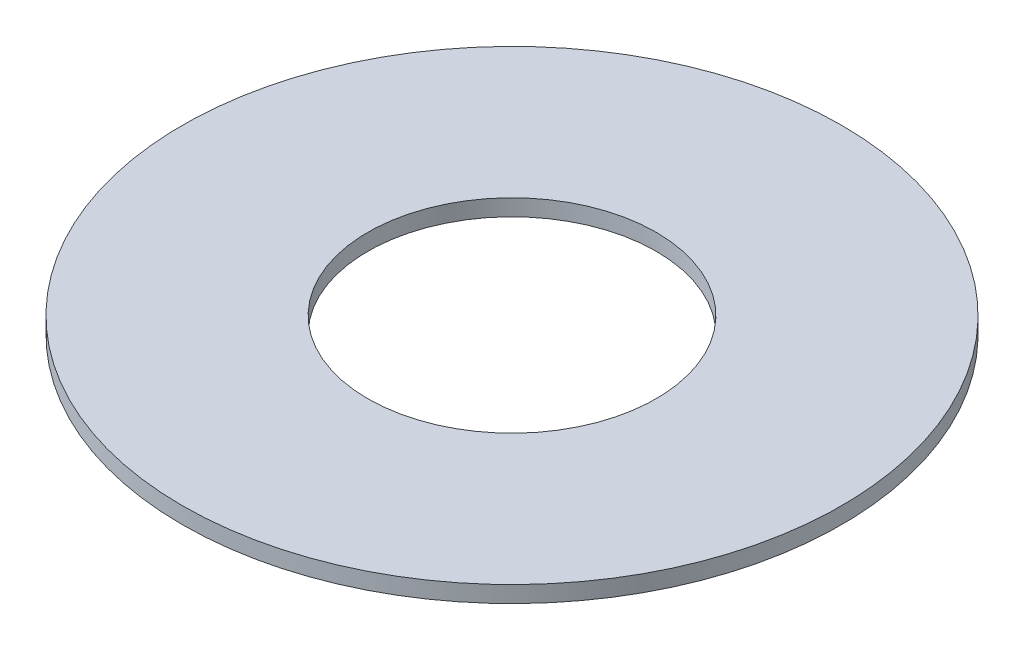
ISO-10303-21;
HEADER;
FILE_DESCRIPTION(('STEP AP214'),'2;1');
FILE_NAME('part.step','',(''),(''),'','','');
FILE_SCHEMA(('AUTOMOTIVE_DESIGN { 1 0 10303 214 1 1 1 1 }'));
ENDSEC;
DATA;
#1=APPLICATION_CONTEXT('core data for automotive mechanical design processes');
#2=APPLICATION_PROTOCOL_DEFINITION('international standard','automotive_design',2000,#1);
#3=PRODUCT_CONTEXT('',#1,'mechanical');
#4=PRODUCT('Part','Part','',(#3));
#5=PRODUCT_RELATED_PRODUCT_CATEGORY('part','',(#4));
#6=PRODUCT_DEFINITION_FORMATION('','',#4);
#7=PRODUCT_DEFINITION_CONTEXT('part definition',#1,'design');
#8=PRODUCT_DEFINITION('design','',#6,#7);
#9=PRODUCT_DEFINITION_SHAPE('','',#8);
#10=(LENGTH_UNIT() NAMED_UNIT(*) SI_UNIT(.MILLI.,.METRE.));
#11=(NAMED_UNIT(*) PLANE_ANGLE_UNIT() SI_UNIT($,.RADIAN.));
#12=(NAMED_UNIT(*) SI_UNIT($,.STERADIAN.) SOLID_ANGLE_UNIT());
#13=UNCERTAINTY_MEASURE_WITH_UNIT(LENGTH_MEASURE(1.E-05),#10,'distance_accuracy_value','');
#14=(GEOMETRIC_REPRESENTATION_CONTEXT(3) GLOBAL_UNCERTAINTY_ASSIGNED_CONTEXT((#13)) GLOBAL_UNIT_ASSIGNED_CONTEXT((#10,
#11,#12)) REPRESENTATION_CONTEXT('',''));
#15=CARTESIAN_POINT('',(0.,0.,0.));
#16=DIRECTION('',(0.,0.,1.));
#17=DIRECTION('',(1.,0.,0.));
#18=AXIS2_PLACEMENT_3D('',#15,#16,#17);
#19=CARTESIAN_POINT('',(0.,4.,0.));
#20=DIRECTION('',(0.,-1.,0.));
#21=DIRECTION('',(0.,0.,-1.));
#22=AXIS2_PLACEMENT_3D('',#19,#20,#21);
#23=CYLINDRICAL_SURFACE('',#22,80.);
#24=CARTESIAN_POINT('',(0.,4.,0.));
#25=DIRECTION('',(0.,1.,0.));
#26=DIRECTION('',(0.,0.,1.));
#27=AXIS2_PLACEMENT_3D('',#24,#25,#26);
#28=CIRCLE('',#27,80.);
#29=CARTESIAN_POINT('',(0.,4.,80.));
#30=VERTEX_POINT('',#29);
#31=EDGE_CURVE('E10',#30,#30,#28,.T.);
#32=ORIENTED_EDGE('',*,*,#31,.F.);
#33=EDGE_LOOP('',(#32));
#34=FACE_BOUND('',#33,.T.);
#35=CARTESIAN_POINT('',(0.,0.,0.));
#36=DIRECTION('',(0.,1.,0.));
#37=DIRECTION('',(0.,0.,1.));
#38=AXIS2_PLACEMENT_3D('',#35,#36,#37);
#39=CIRCLE('',#38,80.);
#40=CARTESIAN_POINT('',(0.,0.,80.));
#41=VERTEX_POINT('',#40);
#42=EDGE_CURVE('E37',#41,#41,#39,.T.);
#43=ORIENTED_EDGE('',*,*,#42,.T.);
#44=EDGE_LOOP('',(#43));
#45=FACE_BOUND('',#44,.T.);
#46=ADVANCED_FACE('F40',(#34,#45),#23,.T.);
#47=CARTESIAN_POINT('',(0.,4.,0.));
#48=DIRECTION('',(0.,1.,0.));
#49=DIRECTION('',(0.,0.,1.));
#50=AXIS2_PLACEMENT_3D('',#47,#48,#49);
#51=PLANE('',#50);
#52=CARTESIAN_POINT('',(0.,4.,0.));
#53=DIRECTION('',(0.,1.,0.));
#54=DIRECTION('',(0.,0.,1.));
#55=AXIS2_PLACEMENT_3D('',#52,#53,#54);
#56=CIRCLE('',#55,35.);
#57=CARTESIAN_POINT('',(0.,4.,35.));
#58=VERTEX_POINT('',#57);
#59=EDGE_CURVE('E50',#58,#58,#56,.T.);
#60=ORIENTED_EDGE('',*,*,#59,.F.);
#61=EDGE_LOOP('',(#60));
#62=FACE_BOUND('',#61,.T.);
#63=ORIENTED_EDGE('',*,*,#31,.T.);
#64=EDGE_LOOP('',(#63));
#65=FACE_BOUND('',#64,.T.);
#66=ADVANCED_FACE('F59',(#62,#65),#51,.T.);
#67=CARTESIAN_POINT('',(0.,0.,0.));
#68=DIRECTION('',(0.,1.,0.));
#69=DIRECTION('',(0.,0.,1.));
#70=AXIS2_PLACEMENT_3D('',#67,#68,#69);
#71=PLANE('',#70);
#72=CARTESIAN_POINT('',(0.,0.,0.));
#73=DIRECTION('',(0.,1.,0.));
#74=DIRECTION('',(0.,0.,1.));
#75=AXIS2_PLACEMENT_3D('',#72,#73,#74);
#76=CIRCLE('',#75,35.);
#77=CARTESIAN_POINT('',(0.,0.,35.));
#78=VERTEX_POINT('',#77);
#79=EDGE_CURVE('E47',#78,#78,#76,.T.);
#80=ORIENTED_EDGE('',*,*,#79,.T.);
#81=EDGE_LOOP('',(#80));
#82=FACE_BOUND('',#81,.T.);
#83=ORIENTED_EDGE('',*,*,#42,.F.);
#84=EDGE_LOOP('',(#83));
#85=FACE_BOUND('',#84,.T.);
#86=ADVANCED_FACE('F58',(#82,#85),#71,.F.);
#87=CARTESIAN_POINT('',(0.,4.,0.));
#88=DIRECTION('',(0.,-1.,0.));
#89=DIRECTION('',(0.,0.,-1.));
#90=AXIS2_PLACEMENT_3D('',#87,#88,#89);
#91=CYLINDRICAL_SURFACE('',#90,35.);
#92=ORIENTED_EDGE('',*,*,#59,.T.);
#93=EDGE_LOOP('',(#92));
#94=FACE_BOUND('',#93,.T.);
#95=ORIENTED_EDGE('',*,*,#79,.F.);
#96=EDGE_LOOP('',(#95));
#97=FACE_BOUND('',#96,.T.);
#98=ADVANCED_FACE('F54',(#94,#97),#91,.F.);
#99=CLOSED_SHELL('',(#46,#66,#86,#98));
#100=MANIFOLD_SOLID_BREP('B2',#99);
#101=ADVANCED_BREP_SHAPE_REPRESENTATION('',(#18,#100),#14);
#102=SHAPE_DEFINITION_REPRESENTATION(#9,#101);
ENDSEC;
END-ISO-10303-21;
